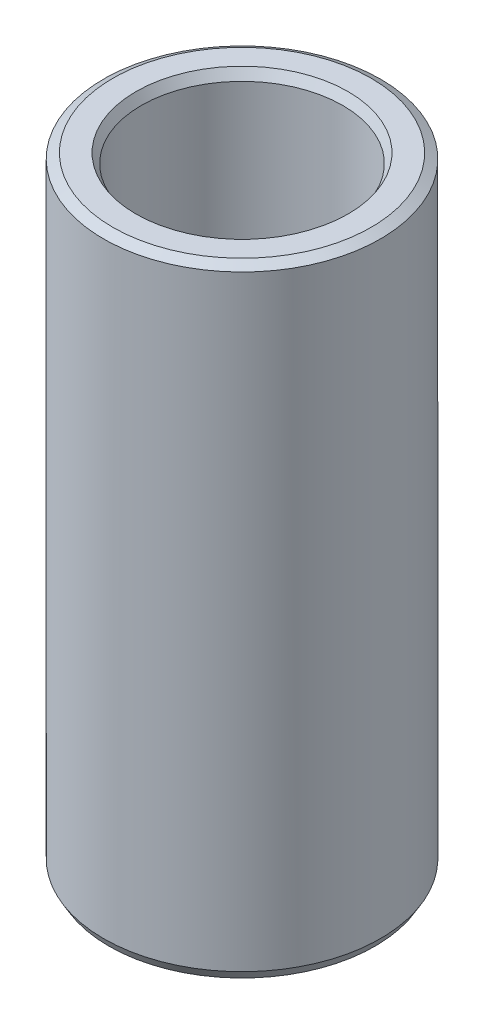
ISO-10303-21;
HEADER;
FILE_DESCRIPTION(('STEP AP214'),'2;1');
FILE_NAME('part.step','',(''),(''),'','','');
FILE_SCHEMA(('AUTOMOTIVE_DESIGN { 1 0 10303 214 1 1 1 1 }'));
ENDSEC;
DATA;
#1=APPLICATION_CONTEXT('core data for automotive mechanical design processes');
#2=APPLICATION_PROTOCOL_DEFINITION('international standard','automotive_design',2000,#1);
#3=PRODUCT_CONTEXT('',#1,'mechanical');
#4=PRODUCT('Part','Part','',(#3));
#5=PRODUCT_RELATED_PRODUCT_CATEGORY('part','',(#4));
#6=PRODUCT_DEFINITION_FORMATION('','',#4);
#7=PRODUCT_DEFINITION_CONTEXT('part definition',#1,'design');
#8=PRODUCT_DEFINITION('design','',#6,#7);
#9=PRODUCT_DEFINITION_SHAPE('','',#8);
#10=(LENGTH_UNIT() NAMED_UNIT(*) SI_UNIT(.MILLI.,.METRE.));
#11=(NAMED_UNIT(*) PLANE_ANGLE_UNIT() SI_UNIT($,.RADIAN.));
#12=(NAMED_UNIT(*) SI_UNIT($,.STERADIAN.) SOLID_ANGLE_UNIT());
#13=UNCERTAINTY_MEASURE_WITH_UNIT(LENGTH_MEASURE(1.E-05),#10,'distance_accuracy_value','');
#14=(GEOMETRIC_REPRESENTATION_CONTEXT(3) GLOBAL_UNCERTAINTY_ASSIGNED_CONTEXT((#13)) GLOBAL_UNIT_ASSIGNED_CONTEXT((#10,
#11,#12)) REPRESENTATION_CONTEXT('',''));
#15=CARTESIAN_POINT('',(0.,0.,0.));
#16=DIRECTION('',(0.,0.,1.));
#17=DIRECTION('',(1.,0.,0.));
#18=AXIS2_PLACEMENT_3D('',#15,#16,#17);
#19=CARTESIAN_POINT('',(0.,112.04756300664,0.));
#20=DIRECTION('',(0.,-1.,0.));
#21=DIRECTION('',(0.,0.,-1.));
#22=AXIS2_PLACEMENT_3D('',#19,#20,#21);
#23=CYLINDRICAL_SURFACE('',#22,25.);
#24=CARTESIAN_POINT('',(0.,1.68053061002027,0.));
#25=DIRECTION('',(0.,1.,0.));
#26=DIRECTION('',(0.,0.,1.));
#27=AXIS2_PLACEMENT_3D('',#24,#25,#26);
#28=CIRCLE('',#27,25.);
#29=CARTESIAN_POINT('',(0.,1.68053061002027,25.));
#30=VERTEX_POINT('',#29);
#31=EDGE_CURVE('E10',#30,#30,#28,.T.);
#32=ORIENTED_EDGE('',*,*,#31,.T.);
#33=EDGE_LOOP('',(#32));
#34=FACE_BOUND('',#33,.T.);
#35=CARTESIAN_POINT('',(0.,111.077308206564,0.));
#36=DIRECTION('',(0.,1.,0.));
#37=DIRECTION('',(0.,0.,1.));
#38=AXIS2_PLACEMENT_3D('',#35,#36,#37);
#39=CIRCLE('',#38,25.);
#40=CARTESIAN_POINT('',(0.,111.077308206564,-25.));
#41=VERTEX_POINT('',#40);
#42=EDGE_CURVE('E50',#41,#41,#39,.F.);
#43=ORIENTED_EDGE('',*,*,#42,.T.);
#44=EDGE_LOOP('',(#43));
#45=FACE_BOUND('',#44,.T.);
#46=ADVANCED_FACE('F39',(#34,#45),#23,.T.);
#47=CARTESIAN_POINT('',(0.,112.04756300664,0.));
#48=DIRECTION('',(0.,1.,0.));
#49=DIRECTION('',(0.,0.,1.));
#50=AXIS2_PLACEMENT_3D('',#47,#48,#49);
#51=PLANE('',#50);
#52=CARTESIAN_POINT('',(0.,112.04756300664,0.));
#53=DIRECTION('',(0.,1.,0.));
#54=DIRECTION('',(0.,0.,1.));
#55=AXIS2_PLACEMENT_3D('',#52,#53,#54);
#56=CIRCLE('',#55,19.1505118709745);
#57=CARTESIAN_POINT('',(0.,112.04756300664,19.1505118709745));
#58=VERTEX_POINT('',#57);
#59=EDGE_CURVE('E58',#58,#58,#56,.F.);
#60=ORIENTED_EDGE('',*,*,#59,.T.);
#61=EDGE_LOOP('',(#60));
#62=FACE_BOUND('',#61,.T.);
#63=CARTESIAN_POINT('',(0.,112.04756300664,0.));
#64=DIRECTION('',(0.,1.,0.));
#65=DIRECTION('',(0.,0.,1.));
#66=AXIS2_PLACEMENT_3D('',#63,#64,#65);
#67=CIRCLE('',#66,23.3194693899797);
#68=CARTESIAN_POINT('',(0.,112.04756300664,-23.3194693899797));
#69=VERTEX_POINT('',#68);
#70=EDGE_CURVE('E61',#69,#69,#67,.T.);
#71=ORIENTED_EDGE('',*,*,#70,.T.);
#72=EDGE_LOOP('',(#71));
#73=FACE_BOUND('',#72,.T.);
#74=ADVANCED_FACE('F88',(#62,#73),#51,.T.);
#75=CARTESIAN_POINT('',(0.,0.,0.));
#76=DIRECTION('',(0.,1.,0.));
#77=DIRECTION('',(0.,0.,1.));
#78=AXIS2_PLACEMENT_3D('',#75,#76,#77);
#79=PLANE('',#78);
#80=CARTESIAN_POINT('',(0.,0.,0.));
#81=DIRECTION('',(0.,1.,0.));
#82=DIRECTION('',(0.,0.,1.));
#83=AXIS2_PLACEMENT_3D('',#80,#81,#82);
#84=CIRCLE('',#83,19.8607876809181);
#85=CARTESIAN_POINT('',(0.,0.,-19.8607876809181));
#86=VERTEX_POINT('',#85);
#87=EDGE_CURVE('E51',#86,#86,#84,.T.);
#88=ORIENTED_EDGE('',*,*,#87,.T.);
#89=EDGE_LOOP('',(#88));
#90=FACE_BOUND('',#89,.T.);
#91=CARTESIAN_POINT('',(0.,0.,0.));
#92=DIRECTION('',(0.,1.,0.));
#93=DIRECTION('',(0.,0.,1.));
#94=AXIS2_PLACEMENT_3D('',#91,#92,#93);
#95=CIRCLE('',#94,24.0297451999234);
#96=CARTESIAN_POINT('',(0.,0.,24.0297451999234));
#97=VERTEX_POINT('',#96);
#98=EDGE_CURVE('E54',#97,#97,#95,.F.);
#99=ORIENTED_EDGE('',*,*,#98,.T.);
#100=EDGE_LOOP('',(#99));
#101=FACE_BOUND('',#100,.T.);
#102=ADVANCED_FACE('F83',(#90,#101),#79,.F.);
#103=CARTESIAN_POINT('',(0.,112.04756300664,0.));
#104=DIRECTION('',(0.,-1.,0.));
#105=DIRECTION('',(0.,0.,-1.));
#106=AXIS2_PLACEMENT_3D('',#103,#104,#105);
#107=CYLINDRICAL_SURFACE('',#106,18.1802570708978);
#108=CARTESIAN_POINT('',(0.,110.36703239662,0.));
#109=DIRECTION('',(0.,1.,0.));
#110=DIRECTION('',(0.,0.,1.));
#111=AXIS2_PLACEMENT_3D('',#108,#109,#110);
#112=CIRCLE('',#111,18.1802570708978);
#113=CARTESIAN_POINT('',(0.,110.36703239662,18.1802570708978));
#114=VERTEX_POINT('',#113);
#115=EDGE_CURVE('E67',#114,#114,#112,.T.);
#116=ORIENTED_EDGE('',*,*,#115,.T.);
#117=EDGE_LOOP('',(#116));
#118=FACE_BOUND('',#117,.T.);
#119=CARTESIAN_POINT('',(0.,0.97025480007662,0.));
#120=DIRECTION('',(0.,1.,0.));
#121=DIRECTION('',(0.,0.,1.));
#122=AXIS2_PLACEMENT_3D('',#119,#120,#121);
#123=CIRCLE('',#122,18.1802570708978);
#124=CARTESIAN_POINT('',(0.,0.97025480007662,-18.1802570708978));
#125=VERTEX_POINT('',#124);
#126=EDGE_CURVE('E69',#125,#125,#123,.F.);
#127=ORIENTED_EDGE('',*,*,#126,.T.);
#128=EDGE_LOOP('',(#127));
#129=FACE_BOUND('',#128,.T.);
#130=ADVANCED_FACE('F71',(#118,#129),#107,.F.);
#131=CARTESIAN_POINT('',(0.,110.36703239662,0.));
#132=DIRECTION('',(0.,1.,0.));
#133=DIRECTION('',(0.,0.,1.));
#134=AXIS2_PLACEMENT_3D('',#131,#132,#133);
#135=CONICAL_SURFACE('',#134,18.1802570708978,0.523598775598299);
#136=ORIENTED_EDGE('',*,*,#59,.F.);
#137=EDGE_LOOP('',(#136));
#138=FACE_BOUND('',#137,.T.);
#139=ORIENTED_EDGE('',*,*,#115,.F.);
#140=EDGE_LOOP('',(#139));
#141=FACE_BOUND('',#140,.T.);
#142=ADVANCED_FACE('F77',(#138,#141),#135,.F.);
#143=CARTESIAN_POINT('',(0.,0.,0.));
#144=DIRECTION('',(0.,-1.,0.));
#145=DIRECTION('',(0.,0.,-1.));
#146=AXIS2_PLACEMENT_3D('',#143,#144,#145);
#147=CONICAL_SURFACE('',#146,19.8607876809181,1.0471975511966);
#148=CARTESIAN_POINT('',(0.,0.97025480007662,-18.1802570708978));
#149=CARTESIAN_POINT('',(0.,0.960147979242488,-18.1977625980855));
#150=CARTESIAN_POINT('',(0.,0.950041158408357,-18.2152681252733));
#151=CARTESIAN_POINT('',(0.,0.929827516740094,-18.2502791796487));
#152=CARTESIAN_POINT('',(0.,0.919720695905962,-18.2677847068364));
#153=CARTESIAN_POINT('',(0.,0.899507054237699,-18.3027957612118));
#154=CARTESIAN_POINT('',(0.,0.889400233403568,-18.3203012883995));
#155=CARTESIAN_POINT('',(0.,0.869186591735305,-18.355312342775));
#156=CARTESIAN_POINT('',(0.,0.859079770901174,-18.3728178699627));
#157=CARTESIAN_POINT('',(0.,0.838866129232911,-18.4078289243381));
#158=CARTESIAN_POINT('',(0.,0.828759308398779,-18.4253344515258));
#159=CARTESIAN_POINT('',(0.,0.808545666730516,-18.4603455059012));
#160=CARTESIAN_POINT('',(0.,0.798438845896385,-18.4778510330889));
#161=CARTESIAN_POINT('',(0.,0.778225204228122,-18.5128620874644));
#162=CARTESIAN_POINT('',(0.,0.768118383393991,-18.5303676146521));
#163=CARTESIAN_POINT('',(0.,0.747904741725728,-18.5653786690275));
#164=CARTESIAN_POINT('',(0.,0.737797920891596,-18.5828841962152));
#165=CARTESIAN_POINT('',(0.,0.717584279223333,-18.6178952505906));
#166=CARTESIAN_POINT('',(0.,0.707477458389202,-18.6354007777783));
#167=CARTESIAN_POINT('',(0.,0.687263816720939,-18.6704118321538));
#168=CARTESIAN_POINT('',(0.,0.677156995886807,-18.6879173593415));
#169=CARTESIAN_POINT('',(0.,0.656943354218545,-18.7229284137169));
#170=CARTESIAN_POINT('',(0.,0.646836533384413,-18.7404339409046));
#171=CARTESIAN_POINT('',(0.,0.62662289171615,-18.77544499528));
#172=CARTESIAN_POINT('',(0.,0.616516070882019,-18.7929505224677));
#173=CARTESIAN_POINT('',(0.,0.596302429213756,-18.8279615768432));
#174=CARTESIAN_POINT('',(0.,0.586195608379624,-18.8454671040309));
#175=CARTESIAN_POINT('',(0.,0.565981966711361,-18.8804781584063));
#176=CARTESIAN_POINT('',(0.,0.55587514587723,-18.897983685594));
#177=CARTESIAN_POINT('',(0.,0.535661504208967,-18.9329947399694));
#178=CARTESIAN_POINT('',(0.,0.525554683374836,-18.9505002671571));
#179=CARTESIAN_POINT('',(0.,0.505341041706573,-18.9855113215326));
#180=CARTESIAN_POINT('',(0.,0.495234220872441,-19.0030168487203));
#181=CARTESIAN_POINT('',(0.,0.475020579204178,-19.0380279030957));
#182=CARTESIAN_POINT('',(0.,0.464913758370047,-19.0555334302834));
#183=CARTESIAN_POINT('',(0.,0.444700116701784,-19.0905444846588));
#184=CARTESIAN_POINT('',(0.,0.434593295867653,-19.1080500118465));
#185=CARTESIAN_POINT('',(0.,0.41437965419939,-19.143061066222));
#186=CARTESIAN_POINT('',(0.,0.404272833365258,-19.1605665934097));
#187=CARTESIAN_POINT('',(0.,0.384059191696995,-19.1955776477851));
#188=CARTESIAN_POINT('',(0.,0.373952370862864,-19.2130831749728));
#189=CARTESIAN_POINT('',(0.,0.353738729194601,-19.2480942293482));
#190=CARTESIAN_POINT('',(0.,0.343631908360469,-19.2655997565359));
#191=CARTESIAN_POINT('',(0.,0.323418266692207,-19.3006108109114));
#192=CARTESIAN_POINT('',(0.,0.313311445858075,-19.3181163380991));
#193=CARTESIAN_POINT('',(0.,0.293097804189812,-19.3531273924745));
#194=CARTESIAN_POINT('',(0.,0.282990983355681,-19.3706329196622));
#195=CARTESIAN_POINT('',(0.,0.262777341687418,-19.4056439740376));
#196=CARTESIAN_POINT('',(0.,0.252670520853286,-19.4231495012253));
#197=CARTESIAN_POINT('',(0.,0.232456879185024,-19.4581605556008));
#198=CARTESIAN_POINT('',(0.,0.222350058350892,-19.4756660827885));
#199=CARTESIAN_POINT('',(0.,0.202136416682629,-19.5106771371639));
#200=CARTESIAN_POINT('',(0.,0.192029595848497,-19.5281826643516));
#201=CARTESIAN_POINT('',(0.,0.171815954180235,-19.563193718727));
#202=CARTESIAN_POINT('',(0.,0.161709133346103,-19.5806992459147));
#203=CARTESIAN_POINT('',(0.,0.141495491677841,-19.6157103002902));
#204=CARTESIAN_POINT('',(0.,0.131388670843709,-19.6332158274779));
#205=CARTESIAN_POINT('',(0.,0.111175029175446,-19.6682268818533));
#206=CARTESIAN_POINT('',(0.,0.101068208341315,-19.685732409041));
#207=CARTESIAN_POINT('',(0.,0.0808545666730517,-19.7207434634164));
#208=CARTESIAN_POINT('',(0.,0.0707477458389202,-19.7382489906041));
#209=CARTESIAN_POINT('',(0.,0.0505341041706573,-19.7732600449796));
#210=CARTESIAN_POINT('',(0.,0.0404272833365258,-19.7907655721673));
#211=CARTESIAN_POINT('',(0.,0.0202136416682629,-19.8257766265427));
#212=CARTESIAN_POINT('',(0.,0.0101068208341314,-19.8432821537304));
#213=CARTESIAN_POINT('',(0.,0.,-19.8607876809181));
#214=B_SPLINE_CURVE_WITH_KNOTS('',3,(#148,#149,#150,#151,#152,#153,#154,#155,#156,#157,#158,
#159,#160,#161,#162,#163,#164,#165,#166,#167,#168,#169,#170,#171,#172,#173,#174,#175,#176,#177,
#178,#179,#180,#181,#182,#183,#184,#185,#186,#187,#188,#189,#190,#191,#192,#193,#194,#195,#196,
#197,#198,#199,#200,#201,#202,#203,#204,#205,#206,#207,#208,#209,#210,#211,#212,#213),
.UNSPECIFIED.,.F.,.F.,(4,2,2,2,2,2,2,2,2,2,2,2,2,2,2,2,2,2,2,2,2,2,2,2,2,2,2,2,2,2,2,2,4),(0.,
0.0606409250047882,0.121281850009576,0.181922775014365,0.242563700019153,0.303204625023941,
0.363845550028732,0.42448647503352,0.485127400038309,0.545768325043097,0.606409250047885,
0.667050175052673,0.727691100057462,0.78833202506225,0.848972950067038,0.909613875071826,
0.970254800076614,1.03089572508141,1.09153665008619,1.15217757509098,1.21281850009577,
1.27345942510056,1.33410035010535,1.39474127511014,1.45538220011492,1.51602312511971,
1.5766640501245,1.63730497512929,1.69794590013408,1.75858682513887,1.81922775014366,
1.87986867514844,1.94050960015323),.UNSPECIFIED.);
#215=EDGE_CURVE('BSEAM73',#125,#86,#214,.T.);
#216=ORIENTED_EDGE('',*,*,#126,.F.);
#217=ORIENTED_EDGE('',*,*,#87,.F.);
#218=ORIENTED_EDGE('',*,*,#215,.T.);
#219=ORIENTED_EDGE('',*,*,#215,.F.);
#220=EDGE_LOOP('',(#216,#218,#217,#219));
#221=FACE_BOUND('',#220,.T.);
#222=ADVANCED_FACE('F73',(#221),#147,.F.);
#223=CARTESIAN_POINT('',(0.,1.68053061002027,0.));
#224=DIRECTION('',(0.,1.,0.));
#225=DIRECTION('',(0.,0.,1.));
#226=AXIS2_PLACEMENT_3D('',#223,#224,#225);
#227=CONICAL_SURFACE('',#226,25.,0.523598775598301);
#228=ORIENTED_EDGE('',*,*,#98,.F.);
#229=EDGE_LOOP('',(#228));
#230=FACE_BOUND('',#229,.T.);
#231=ORIENTED_EDGE('',*,*,#31,.F.);
#232=EDGE_LOOP('',(#231));
#233=FACE_BOUND('',#232,.T.);
#234=ADVANCED_FACE('F76',(#230,#233),#227,.T.);
#235=CARTESIAN_POINT('',(0.,112.04756300664,0.));
#236=DIRECTION('',(0.,-1.,0.));
#237=DIRECTION('',(0.,0.,-1.));
#238=AXIS2_PLACEMENT_3D('',#235,#236,#237);
#239=CONICAL_SURFACE('',#238,23.3194693899797,1.04719755119659);
#240=CARTESIAN_POINT('',(0.,111.077308206564,-25.));
#241=CARTESIAN_POINT('',(0.,111.087415027398,-24.9824944728123));
#242=CARTESIAN_POINT('',(0.,111.097521848232,-24.9649889456246));
#243=CARTESIAN_POINT('',(0.,111.1177354899,-24.9299778912492));
#244=CARTESIAN_POINT('',(0.,111.127842310734,-24.9124723640615));
#245=CARTESIAN_POINT('',(0.,111.148055952403,-24.877461309686));
#246=CARTESIAN_POINT('',(0.,111.158162773237,-24.8599557824983));
#247=CARTESIAN_POINT('',(0.,111.178376414905,-24.8249447281229));
#248=CARTESIAN_POINT('',(0.,111.188483235739,-24.8074392009352));
#249=CARTESIAN_POINT('',(0.,111.208696877407,-24.7724281465598));
#250=CARTESIAN_POINT('',(0.,111.218803698241,-24.7549226193721));
#251=CARTESIAN_POINT('',(0.,111.23901733991,-24.7199115649966));
#252=CARTESIAN_POINT('',(0.,111.249124160744,-24.7024060378089));
#253=CARTESIAN_POINT('',(0.,111.269337802412,-24.6673949834335));
#254=CARTESIAN_POINT('',(0.,111.279444623246,-24.6498894562458));
#255=CARTESIAN_POINT('',(0.,111.299658264915,-24.6148784018704));
#256=CARTESIAN_POINT('',(0.,111.309765085749,-24.5973728746827));
#257=CARTESIAN_POINT('',(0.,111.329978727417,-24.5623618203072));
#258=CARTESIAN_POINT('',(0.,111.340085548251,-24.5448562931195));
#259=CARTESIAN_POINT('',(0.,111.360299189919,-24.5098452387441));
#260=CARTESIAN_POINT('',(0.,111.370406010753,-24.4923397115564));
#261=CARTESIAN_POINT('',(0.,111.390619652422,-24.457328657181));
#262=CARTESIAN_POINT('',(0.,111.400726473256,-24.4398231299933));
#263=CARTESIAN_POINT('',(0.,111.420940114924,-24.4048120756178));
#264=CARTESIAN_POINT('',(0.,111.431046935758,-24.3873065484301));
#265=CARTESIAN_POINT('',(0.,111.451260577427,-24.3522954940547));
#266=CARTESIAN_POINT('',(0.,111.461367398261,-24.334789966867));
#267=CARTESIAN_POINT('',(0.,111.481581039929,-24.2997789124916));
#268=CARTESIAN_POINT('',(0.,111.491687860763,-24.2822733853039));
#269=CARTESIAN_POINT('',(0.,111.511901502431,-24.2472623309284));
#270=CARTESIAN_POINT('',(0.,111.522008323265,-24.2297568037407));
#271=CARTESIAN_POINT('',(0.,111.542221964934,-24.1947457493653));
#272=CARTESIAN_POINT('',(0.,111.552328785768,-24.1772402221776));
#273=CARTESIAN_POINT('',(0.,111.572542427436,-24.1422291678022));
#274=CARTESIAN_POINT('',(0.,111.58264924827,-24.1247236406145));
#275=CARTESIAN_POINT('',(0.,111.602862889938,-24.089712586239));
#276=CARTESIAN_POINT('',(0.,111.612969710773,-24.0722070590513));
#277=CARTESIAN_POINT('',(0.,111.633183352441,-24.0371960046759));
#278=CARTESIAN_POINT('',(0.,111.643290173275,-24.0196904774882));
#279=CARTESIAN_POINT('',(0.,111.663503814943,-23.9846794231128));
#280=CARTESIAN_POINT('',(0.,111.673610635777,-23.9671738959251));
#281=CARTESIAN_POINT('',(0.,111.693824277446,-23.9321628415496));
#282=CARTESIAN_POINT('',(0.,111.70393109828,-23.9146573143619));
#283=CARTESIAN_POINT('',(0.,111.724144739948,-23.8796462599865));
#284=CARTESIAN_POINT('',(0.,111.734251560782,-23.8621407327988));
#285=CARTESIAN_POINT('',(0.,111.75446520245,-23.8271296784234));
#286=CARTESIAN_POINT('',(0.,111.764572023285,-23.8096241512356));
#287=CARTESIAN_POINT('',(0.,111.784785664953,-23.7746130968602));
#288=CARTESIAN_POINT('',(0.,111.794892485787,-23.7571075696725));
#289=CARTESIAN_POINT('',(0.,111.815106127455,-23.7220965152971));
#290=CARTESIAN_POINT('',(0.,111.825212948289,-23.7045909881094));
#291=CARTESIAN_POINT('',(0.,111.845426589958,-23.669579933734));
#292=CARTESIAN_POINT('',(0.,111.855533410792,-23.6520744065463));
#293=CARTESIAN_POINT('',(0.,111.87574705246,-23.6170633521708));
#294=CARTESIAN_POINT('',(0.,111.885853873294,-23.5995578249831));
#295=CARTESIAN_POINT('',(0.,111.906067514962,-23.5645467706077));
#296=CARTESIAN_POINT('',(0.,111.916174335797,-23.54704124342));
#297=CARTESIAN_POINT('',(0.,111.936387977465,-23.5120301890446));
#298=CARTESIAN_POINT('',(0.,111.946494798299,-23.4945246618569));
#299=CARTESIAN_POINT('',(0.,111.966708439967,-23.4595136074814));
#300=CARTESIAN_POINT('',(0.,111.976815260801,-23.4420080802937));
#301=CARTESIAN_POINT('',(0.,111.99702890247,-23.4069970259183));
#302=CARTESIAN_POINT('',(0.,112.007135723304,-23.3894914987306));
#303=CARTESIAN_POINT('',(0.,112.027349364972,-23.3544804443552));
#304=CARTESIAN_POINT('',(0.,112.037456185806,-23.3369749171674));
#305=CARTESIAN_POINT('',(0.,112.04756300664,-23.3194693899797));
#306=B_SPLINE_CURVE_WITH_KNOTS('',3,(#240,#241,#242,#243,#244,#245,#246,#247,#248,#249,#250,
#251,#252,#253,#254,#255,#256,#257,#258,#259,#260,#261,#262,#263,#264,#265,#266,#267,#268,#269,
#270,#271,#272,#273,#274,#275,#276,#277,#278,#279,#280,#281,#282,#283,#284,#285,#286,#287,#288,
#289,#290,#291,#292,#293,#294,#295,#296,#297,#298,#299,#300,#301,#302,#303,#304,#305),
.UNSPECIFIED.,.F.,.F.,(4,2,2,2,2,2,2,2,2,2,2,2,2,2,2,2,2,2,2,2,2,2,2,2,2,2,2,2,2,2,2,2,4),(0.,
0.060640925004786,0.121281850009576,0.181922775014366,0.242563700019156,0.303204625023939,
0.363845550028729,0.424486475033519,0.485127400038309,0.545768325043099,0.606409250047882,
0.667050175052672,0.727691100057462,0.788332025062251,0.848972950067034,0.909613875071824,
0.970254800076617,1.03089572508141,1.0915366500862,1.15217757509098,1.21281850009577,
1.27345942510056,1.33410035010535,1.39474127511013,1.45538220011492,1.51602312511971,
1.5766640501245,1.63730497512929,1.69794590013408,1.75858682513887,1.81922775014366,
1.87986867514845,1.94050960015324),.UNSPECIFIED.);
#307=EDGE_CURVE('BSEAM45',#41,#69,#306,.T.);
#308=ORIENTED_EDGE('',*,*,#42,.F.);
#309=ORIENTED_EDGE('',*,*,#70,.F.);
#310=ORIENTED_EDGE('',*,*,#307,.T.);
#311=ORIENTED_EDGE('',*,*,#307,.F.);
#312=EDGE_LOOP('',(#308,#310,#309,#311));
#313=FACE_BOUND('',#312,.T.);
#314=ADVANCED_FACE('F45',(#313),#239,.T.);
#315=CLOSED_SHELL('',(#46,#74,#102,#130,#142,#222,#234,#314));
#316=MANIFOLD_SOLID_BREP('B2',#315);
#317=ADVANCED_BREP_SHAPE_REPRESENTATION('',(#18,#316),#14);
#318=SHAPE_DEFINITION_REPRESENTATION(#9,#317);
ENDSEC;
END-ISO-10303-21;
